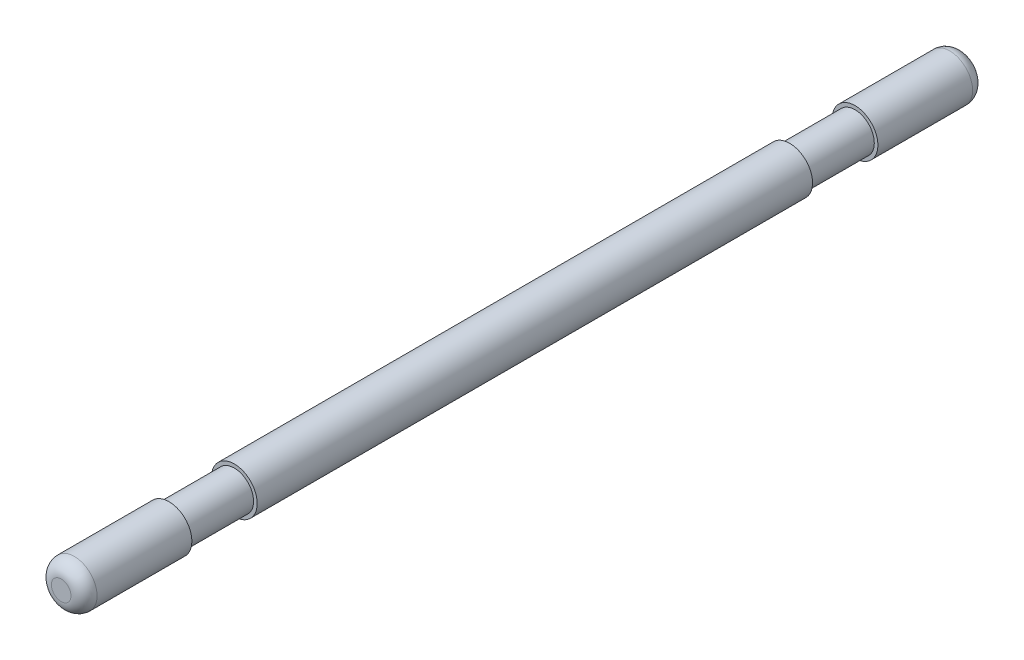
ISO-10303-21;
HEADER;
FILE_DESCRIPTION(('STEP AP214'),'2;1');
FILE_NAME('part.step','',(''),(''),'','','');
FILE_SCHEMA(('AUTOMOTIVE_DESIGN { 1 0 10303 214 1 1 1 1 }'));
ENDSEC;
DATA;
#1=APPLICATION_CONTEXT('core data for automotive mechanical design processes');
#2=APPLICATION_PROTOCOL_DEFINITION('international standard','automotive_design',2000,#1);
#3=PRODUCT_CONTEXT('',#1,'mechanical');
#4=PRODUCT('Part','Part','',(#3));
#5=PRODUCT_RELATED_PRODUCT_CATEGORY('part','',(#4));
#6=PRODUCT_DEFINITION_FORMATION('','',#4);
#7=PRODUCT_DEFINITION_CONTEXT('part definition',#1,'design');
#8=PRODUCT_DEFINITION('design','',#6,#7);
#9=PRODUCT_DEFINITION_SHAPE('','',#8);
#10=(LENGTH_UNIT() NAMED_UNIT(*) SI_UNIT(.MILLI.,.METRE.));
#11=(NAMED_UNIT(*) PLANE_ANGLE_UNIT() SI_UNIT($,.RADIAN.));
#12=(NAMED_UNIT(*) SI_UNIT($,.STERADIAN.) SOLID_ANGLE_UNIT());
#13=UNCERTAINTY_MEASURE_WITH_UNIT(LENGTH_MEASURE(1.E-05),#10,'distance_accuracy_value','');
#14=(GEOMETRIC_REPRESENTATION_CONTEXT(3) GLOBAL_UNCERTAINTY_ASSIGNED_CONTEXT((#13)) GLOBAL_UNIT_ASSIGNED_CONTEXT((#10,
#11,#12)) REPRESENTATION_CONTEXT('',''));
#15=CARTESIAN_POINT('',(0.,0.,0.));
#16=DIRECTION('',(0.,0.,1.));
#17=DIRECTION('',(1.,0.,0.));
#18=AXIS2_PLACEMENT_3D('',#15,#16,#17);
#19=CARTESIAN_POINT('',(0.,0.,130.));
#20=DIRECTION('',(0.,0.,-1.));
#21=DIRECTION('',(-1.,0.,0.));
#22=AXIS2_PLACEMENT_3D('',#19,#20,#21);
#23=CYLINDRICAL_SURFACE('',#22,7.);
#24=CARTESIAN_POINT('',(0.,0.,-85.));
#25=DIRECTION('',(0.,0.,1.));
#26=DIRECTION('',(1.,0.,0.));
#27=AXIS2_PLACEMENT_3D('',#24,#25,#26);
#28=CIRCLE('',#27,7.);
#29=CARTESIAN_POINT('',(7.,0.,-85.));
#30=VERTEX_POINT('',#29);
#31=EDGE_CURVE('E87',#30,#30,#28,.T.);
#32=ORIENTED_EDGE('',*,*,#31,.T.);
#33=EDGE_LOOP('',(#32));
#34=FACE_BOUND('',#33,.T.);
#35=CARTESIAN_POINT('',(0.,0.,85.));
#36=DIRECTION('',(0.,0.,1.));
#37=DIRECTION('',(1.,0.,0.));
#38=AXIS2_PLACEMENT_3D('',#35,#36,#37);
#39=CIRCLE('',#38,7.);
#40=CARTESIAN_POINT('',(7.,0.,85.));
#41=VERTEX_POINT('',#40);
#42=EDGE_CURVE('E77',#41,#41,#39,.T.);
#43=ORIENTED_EDGE('',*,*,#42,.F.);
#44=EDGE_LOOP('',(#43));
#45=FACE_BOUND('',#44,.T.);
#46=ADVANCED_FACE('F44',(#34,#45),#23,.T.);
#47=CARTESIAN_POINT('',(0.,0.,85.));
#48=DIRECTION('',(0.,0.,1.));
#49=DIRECTION('',(1.,0.,0.));
#50=AXIS2_PLACEMENT_3D('',#47,#48,#49);
#51=PLANE('',#50);
#52=CARTESIAN_POINT('',(0.,0.,85.));
#53=DIRECTION('',(0.,0.,1.));
#54=DIRECTION('',(1.,0.,0.));
#55=AXIS2_PLACEMENT_3D('',#52,#53,#54);
#56=CIRCLE('',#55,5.9);
#57=CARTESIAN_POINT('',(5.9,0.,85.));
#58=VERTEX_POINT('',#57);
#59=EDGE_CURVE('E81',#58,#58,#56,.T.);
#60=ORIENTED_EDGE('',*,*,#59,.F.);
#61=EDGE_LOOP('',(#60));
#62=FACE_BOUND('',#61,.T.);
#63=ORIENTED_EDGE('',*,*,#42,.T.);
#64=EDGE_LOOP('',(#63));
#65=FACE_BOUND('',#64,.T.);
#66=ADVANCED_FACE('F123',(#62,#65),#51,.T.);
#67=CARTESIAN_POINT('',(0.,0.,105.));
#68=DIRECTION('',(0.,0.,1.));
#69=DIRECTION('',(1.,0.,0.));
#70=AXIS2_PLACEMENT_3D('',#67,#68,#69);
#71=PLANE('',#70);
#72=CARTESIAN_POINT('',(0.,0.,105.));
#73=DIRECTION('',(0.,0.,1.));
#74=DIRECTION('',(1.,0.,0.));
#75=AXIS2_PLACEMENT_3D('',#72,#73,#74);
#76=CIRCLE('',#75,5.9);
#77=CARTESIAN_POINT('',(5.9,0.,105.));
#78=VERTEX_POINT('',#77);
#79=EDGE_CURVE('E84',#78,#78,#76,.T.);
#80=ORIENTED_EDGE('',*,*,#79,.T.);
#81=EDGE_LOOP('',(#80));
#82=FACE_BOUND('',#81,.T.);
#83=CARTESIAN_POINT('',(0.,0.,105.));
#84=DIRECTION('',(0.,0.,1.));
#85=DIRECTION('',(1.,0.,0.));
#86=AXIS2_PLACEMENT_3D('',#83,#84,#85);
#87=CIRCLE('',#86,7.);
#88=CARTESIAN_POINT('',(7.,0.,105.));
#89=VERTEX_POINT('',#88);
#90=EDGE_CURVE('E78',#89,#89,#87,.T.);
#91=ORIENTED_EDGE('',*,*,#90,.F.);
#92=EDGE_LOOP('',(#91));
#93=FACE_BOUND('',#92,.T.);
#94=ADVANCED_FACE('F130',(#82,#93),#71,.F.);
#95=CARTESIAN_POINT('',(0.,0.,85.));
#96=DIRECTION('',(0.,0.,1.));
#97=DIRECTION('',(1.,0.,0.));
#98=AXIS2_PLACEMENT_3D('',#95,#96,#97);
#99=CYLINDRICAL_SURFACE('',#98,5.9);
#100=ORIENTED_EDGE('',*,*,#59,.T.);
#101=EDGE_LOOP('',(#100));
#102=FACE_BOUND('',#101,.T.);
#103=ORIENTED_EDGE('',*,*,#79,.F.);
#104=EDGE_LOOP('',(#103));
#105=FACE_BOUND('',#104,.T.);
#106=ADVANCED_FACE('F235',(#102,#105),#99,.T.);
#107=CARTESIAN_POINT('',(0.,0.,138.));
#108=DIRECTION('',(0.,0.,1.));
#109=DIRECTION('',(1.,0.,0.));
#110=AXIS2_PLACEMENT_3D('',#107,#108,#109);
#111=PLANE('',#110);
#112=CARTESIAN_POINT('',(0.,0.,138.));
#113=DIRECTION('',(0.,0.,1.));
#114=DIRECTION('',(1.,0.,0.));
#115=AXIS2_PLACEMENT_3D('',#112,#113,#114);
#116=CIRCLE('',#115,3.);
#117=CARTESIAN_POINT('',(3.,0.,138.));
#118=VERTEX_POINT('',#117);
#119=EDGE_CURVE('E52',#118,#118,#116,.T.);
#120=ORIENTED_EDGE('',*,*,#119,.T.);
#121=EDGE_LOOP('',(#120));
#122=FACE_BOUND('',#121,.T.);
#123=ADVANCED_FACE('F231',(#122),#111,.T.);
#124=CARTESIAN_POINT('',(0.,0.,134.));
#125=DIRECTION('',(0.,0.,1.));
#126=DIRECTION('',(1.,0.,0.));
#127=AXIS2_PLACEMENT_3D('',#124,#125,#126);
#128=DEGENERATE_TOROIDAL_SURFACE('',#127,3.,4.,.T.);
#129=CARTESIAN_POINT('',(0.,0.,134.));
#130=DIRECTION('',(0.,0.,1.));
#131=DIRECTION('',(1.,0.,0.));
#132=AXIS2_PLACEMENT_3D('',#129,#130,#131);
#133=CIRCLE('',#132,7.);
#134=CARTESIAN_POINT('',(7.,0.,134.));
#135=VERTEX_POINT('',#134);
#136=EDGE_CURVE('E11',#135,#135,#133,.F.);
#137=ORIENTED_EDGE('',*,*,#136,.F.);
#138=EDGE_LOOP('',(#137));
#139=FACE_BOUND('',#138,.T.);
#140=ORIENTED_EDGE('',*,*,#119,.F.);
#141=EDGE_LOOP('',(#140));
#142=FACE_BOUND('',#141,.T.);
#143=ADVANCED_FACE('F46',(#139,#142),#128,.T.);
#144=ORIENTED_EDGE('',*,*,#90,.T.);
#145=EDGE_LOOP('',(#144));
#146=FACE_BOUND('',#145,.T.);
#147=ORIENTED_EDGE('',*,*,#136,.T.);
#148=EDGE_LOOP('',(#147));
#149=FACE_BOUND('',#148,.T.);
#150=ADVANCED_FACE('F118',(#146,#149),#23,.T.);
#151=CARTESIAN_POINT('',(0.,0.,-85.));
#152=DIRECTION('',(0.,0.,1.));
#153=DIRECTION('',(1.,0.,0.));
#154=AXIS2_PLACEMENT_3D('',#151,#152,#153);
#155=PLANE('',#154);
#156=ORIENTED_EDGE('',*,*,#31,.F.);
#157=EDGE_LOOP('',(#156));
#158=FACE_BOUND('',#157,.T.);
#159=CARTESIAN_POINT('',(0.,0.,-85.));
#160=DIRECTION('',(0.,0.,1.));
#161=DIRECTION('',(1.,0.,0.));
#162=AXIS2_PLACEMENT_3D('',#159,#160,#161);
#163=CIRCLE('',#162,5.9);
#164=CARTESIAN_POINT('',(5.9,0.,-85.));
#165=VERTEX_POINT('',#164);
#166=EDGE_CURVE('E93',#165,#165,#163,.T.);
#167=ORIENTED_EDGE('',*,*,#166,.T.);
#168=EDGE_LOOP('',(#167));
#169=FACE_BOUND('',#168,.T.);
#170=ADVANCED_FACE('F102',(#158,#169),#155,.F.);
#171=CARTESIAN_POINT('',(0.,0.,-105.));
#172=DIRECTION('',(0.,0.,1.));
#173=DIRECTION('',(1.,0.,0.));
#174=AXIS2_PLACEMENT_3D('',#171,#172,#173);
#175=PLANE('',#174);
#176=CARTESIAN_POINT('',(0.,0.,-105.));
#177=DIRECTION('',(0.,0.,1.));
#178=DIRECTION('',(1.,0.,0.));
#179=AXIS2_PLACEMENT_3D('',#176,#177,#178);
#180=CIRCLE('',#179,7.);
#181=CARTESIAN_POINT('',(7.,0.,-105.));
#182=VERTEX_POINT('',#181);
#183=EDGE_CURVE('E90',#182,#182,#180,.T.);
#184=ORIENTED_EDGE('',*,*,#183,.T.);
#185=EDGE_LOOP('',(#184));
#186=FACE_BOUND('',#185,.T.);
#187=CARTESIAN_POINT('',(0.,0.,-105.));
#188=DIRECTION('',(0.,0.,1.));
#189=DIRECTION('',(1.,0.,0.));
#190=AXIS2_PLACEMENT_3D('',#187,#188,#189);
#191=CIRCLE('',#190,5.9);
#192=CARTESIAN_POINT('',(5.9,0.,-105.));
#193=VERTEX_POINT('',#192);
#194=EDGE_CURVE('E96',#193,#193,#191,.T.);
#195=ORIENTED_EDGE('',*,*,#194,.F.);
#196=EDGE_LOOP('',(#195));
#197=FACE_BOUND('',#196,.T.);
#198=ADVANCED_FACE('F108',(#186,#197),#175,.T.);
#199=CARTESIAN_POINT('',(0.,0.,-85.));
#200=DIRECTION('',(0.,0.,-1.));
#201=DIRECTION('',(-1.,0.,0.));
#202=AXIS2_PLACEMENT_3D('',#199,#200,#201);
#203=CYLINDRICAL_SURFACE('',#202,5.9);
#204=ORIENTED_EDGE('',*,*,#166,.F.);
#205=EDGE_LOOP('',(#204));
#206=FACE_BOUND('',#205,.T.);
#207=ORIENTED_EDGE('',*,*,#194,.T.);
#208=EDGE_LOOP('',(#207));
#209=FACE_BOUND('',#208,.T.);
#210=ADVANCED_FACE('F104',(#206,#209),#203,.T.);
#211=CARTESIAN_POINT('',(0.,0.,-138.));
#212=DIRECTION('',(0.,0.,-1.));
#213=DIRECTION('',(-1.,0.,0.));
#214=AXIS2_PLACEMENT_3D('',#211,#212,#213);
#215=PLANE('',#214);
#216=CARTESIAN_POINT('',(0.,0.,-138.));
#217=DIRECTION('',(0.,0.,-1.));
#218=DIRECTION('',(-1.,0.,0.));
#219=AXIS2_PLACEMENT_3D('',#216,#217,#218);
#220=CIRCLE('',#219,3.);
#221=CARTESIAN_POINT('',(-3.,0.,-138.));
#222=VERTEX_POINT('',#221);
#223=EDGE_CURVE('E65',#222,#222,#220,.T.);
#224=ORIENTED_EDGE('',*,*,#223,.T.);
#225=EDGE_LOOP('',(#224));
#226=FACE_BOUND('',#225,.T.);
#227=ADVANCED_FACE('F107',(#226),#215,.T.);
#228=CARTESIAN_POINT('',(0.,0.,-134.));
#229=DIRECTION('',(0.,0.,-1.));
#230=DIRECTION('',(-1.,0.,0.));
#231=AXIS2_PLACEMENT_3D('',#228,#229,#230);
#232=DEGENERATE_TOROIDAL_SURFACE('',#231,3.,4.,.T.);
#233=CARTESIAN_POINT('',(0.,0.,-134.));
#234=DIRECTION('',(0.,0.,-1.));
#235=DIRECTION('',(-1.,0.,0.));
#236=AXIS2_PLACEMENT_3D('',#233,#234,#235);
#237=CIRCLE('',#236,7.);
#238=CARTESIAN_POINT('',(-7.,0.,-134.));
#239=VERTEX_POINT('',#238);
#240=EDGE_CURVE('E60',#239,#239,#237,.F.);
#241=ORIENTED_EDGE('',*,*,#240,.F.);
#242=EDGE_LOOP('',(#241));
#243=FACE_BOUND('',#242,.T.);
#244=ORIENTED_EDGE('',*,*,#223,.F.);
#245=EDGE_LOOP('',(#244));
#246=FACE_BOUND('',#245,.T.);
#247=ADVANCED_FACE('F138',(#243,#246),#232,.T.);
#248=ORIENTED_EDGE('',*,*,#240,.T.);
#249=EDGE_LOOP('',(#248));
#250=FACE_BOUND('',#249,.T.);
#251=ORIENTED_EDGE('',*,*,#183,.F.);
#252=EDGE_LOOP('',(#251));
#253=FACE_BOUND('',#252,.T.);
#254=ADVANCED_FACE('F126',(#250,#253),#23,.T.);
#255=CLOSED_SHELL('',(#46,#66,#94,#106,#123,#143,#150,#170,#198,#210,#227,#247,#254));
#256=CARTESIAN_POINT('',(0.,0.,130.));
#257=DIRECTION('',(0.,0.,1.));
#258=DIRECTION('',(1.,0.,0.));
#259=AXIS2_PLACEMENT_3D('',#256,#257,#258);
#260=PLANE('',#259);
#261=CARTESIAN_POINT('',(0.,0.,130.));
#262=DIRECTION('',(0.,0.,1.));
#263=DIRECTION('',(1.,0.,0.));
#264=AXIS2_PLACEMENT_3D('',#261,#262,#263);
#265=CIRCLE('',#264,2.9);
#266=CARTESIAN_POINT('',(2.9,0.,130.));
#267=VERTEX_POINT('',#266);
#268=EDGE_CURVE('E56',#267,#267,#265,.F.);
#269=ORIENTED_EDGE('',*,*,#268,.F.);
#270=EDGE_LOOP('',(#269));
#271=FACE_BOUND('',#270,.T.);
#272=ADVANCED_FACE('F170',(#271),#260,.T.);
#273=CARTESIAN_POINT('',(0.,0.,135.));
#274=DIRECTION('',(0.,0.,-1.));
#275=DIRECTION('',(-1.,0.,0.));
#276=AXIS2_PLACEMENT_3D('',#273,#274,#275);
#277=CYLINDRICAL_SURFACE('',#276,2.9);
#278=CARTESIAN_POINT('',(0.,0.,135.));
#279=DIRECTION('',(0.,0.,1.));
#280=DIRECTION('',(1.,0.,0.));
#281=AXIS2_PLACEMENT_3D('',#278,#279,#280);
#282=CIRCLE('',#281,2.9);
#283=CARTESIAN_POINT('',(2.9,0.,135.));
#284=VERTEX_POINT('',#283);
#285=EDGE_CURVE('E74',#284,#284,#282,.T.);
#286=ORIENTED_EDGE('',*,*,#285,.T.);
#287=EDGE_LOOP('',(#286));
#288=FACE_BOUND('',#287,.T.);
#289=ORIENTED_EDGE('',*,*,#268,.T.);
#290=EDGE_LOOP('',(#289));
#291=FACE_BOUND('',#290,.T.);
#292=ADVANCED_FACE('F157',(#288,#291),#277,.F.);
#293=CARTESIAN_POINT('',(0.,0.,135.));
#294=DIRECTION('',(0.,0.,1.));
#295=DIRECTION('',(1.,0.,0.));
#296=AXIS2_PLACEMENT_3D('',#293,#294,#295);
#297=PLANE('',#296);
#298=ORIENTED_EDGE('',*,*,#285,.F.);
#299=EDGE_LOOP('',(#298));
#300=FACE_BOUND('',#299,.T.);
#301=ADVANCED_FACE('F185',(#300),#297,.F.);
#302=CLOSED_SHELL('',(#272,#292,#301));
#303=CARTESIAN_POINT('',(0.,0.,-130.));
#304=DIRECTION('',(0.,0.,1.));
#305=DIRECTION('',(1.,0.,0.));
#306=AXIS2_PLACEMENT_3D('',#303,#304,#305);
#307=PLANE('',#306);
#308=CARTESIAN_POINT('',(0.,0.,-130.));
#309=DIRECTION('',(0.,0.,-1.));
#310=DIRECTION('',(-1.,0.,0.));
#311=AXIS2_PLACEMENT_3D('',#308,#309,#310);
#312=CIRCLE('',#311,3.75916188225926);
#313=CARTESIAN_POINT('',(-3.75916188225926,0.,-130.));
#314=VERTEX_POINT('',#313);
#315=EDGE_CURVE('E68',#314,#314,#312,.T.);
#316=ORIENTED_EDGE('',*,*,#315,.T.);
#317=EDGE_LOOP('',(#316));
#318=FACE_BOUND('',#317,.T.);
#319=ADVANCED_FACE('F168',(#318),#307,.F.);
#320=CARTESIAN_POINT('',(0.,0.,-135.));
#321=DIRECTION('',(0.,0.,1.));
#322=DIRECTION('',(1.,0.,0.));
#323=AXIS2_PLACEMENT_3D('',#320,#321,#322);
#324=CYLINDRICAL_SURFACE('',#323,3.75916188225926);
#325=CARTESIAN_POINT('',(0.,0.,-135.));
#326=DIRECTION('',(0.,0.,-1.));
#327=DIRECTION('',(-1.,0.,0.));
#328=AXIS2_PLACEMENT_3D('',#325,#326,#327);
#329=CIRCLE('',#328,3.75916188225926);
#330=CARTESIAN_POINT('',(-3.75916188225926,0.,-135.));
#331=VERTEX_POINT('',#330);
#332=EDGE_CURVE('E71',#331,#331,#329,.T.);
#333=ORIENTED_EDGE('',*,*,#332,.T.);
#334=EDGE_LOOP('',(#333));
#335=FACE_BOUND('',#334,.T.);
#336=ORIENTED_EDGE('',*,*,#315,.F.);
#337=EDGE_LOOP('',(#336));
#338=FACE_BOUND('',#337,.T.);
#339=ADVANCED_FACE('F162',(#335,#338),#324,.F.);
#340=CARTESIAN_POINT('',(0.,0.,-135.));
#341=DIRECTION('',(0.,0.,-1.));
#342=DIRECTION('',(-1.,0.,0.));
#343=AXIS2_PLACEMENT_3D('',#340,#341,#342);
#344=PLANE('',#343);
#345=ORIENTED_EDGE('',*,*,#332,.F.);
#346=EDGE_LOOP('',(#345));
#347=FACE_BOUND('',#346,.T.);
#348=ADVANCED_FACE('F159',(#347),#344,.F.);
#349=CLOSED_SHELL('',(#319,#339,#348));
#350=ORIENTED_CLOSED_SHELL('',*,#302,.T.);
#351=ORIENTED_CLOSED_SHELL('',*,#349,.T.);
#352=BREP_WITH_VOIDS('B2',#255,(#350,#351));
#353=ADVANCED_BREP_SHAPE_REPRESENTATION('',(#18,#352),#14);
#354=SHAPE_DEFINITION_REPRESENTATION(#9,#353);
ENDSEC;
END-ISO-10303-21;
